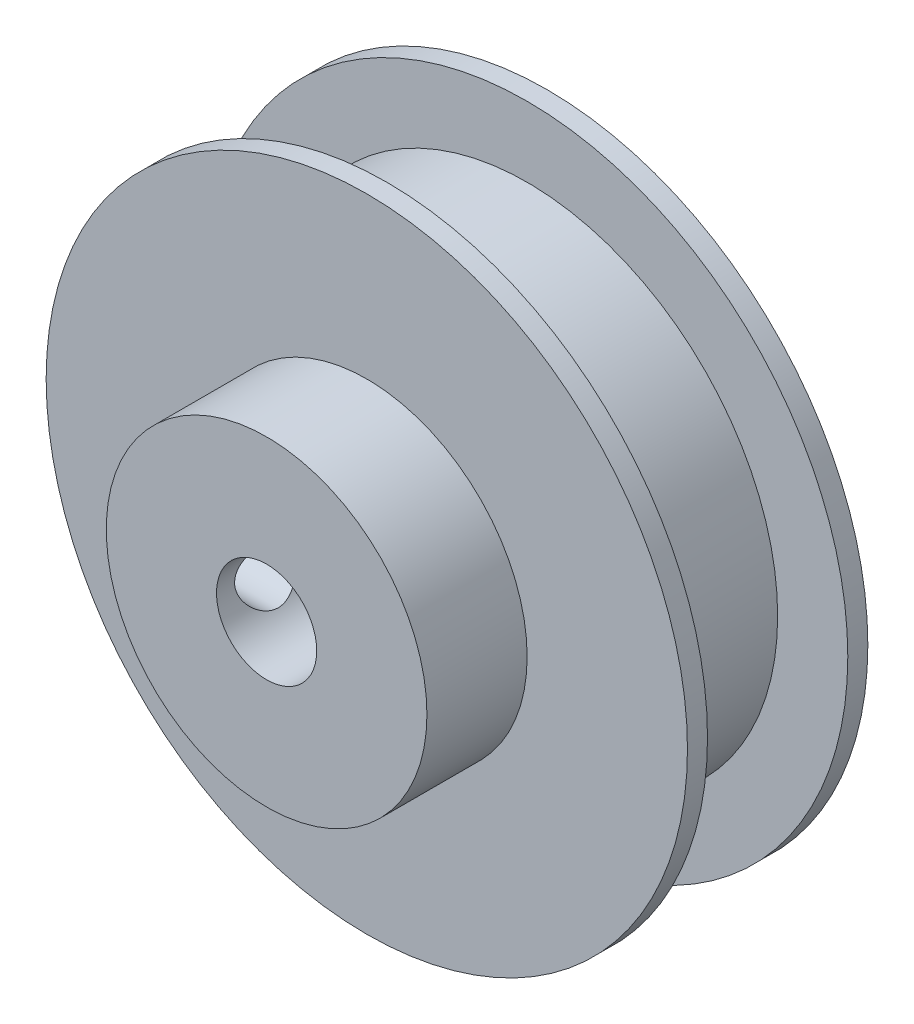
ISO-10303-21;
HEADER;
FILE_DESCRIPTION(('STEP AP214'),'2;1');
FILE_NAME('part.step','',(''),(''),'','','');
FILE_SCHEMA(('AUTOMOTIVE_DESIGN { 1 0 10303 214 1 1 1 1 }'));
ENDSEC;
DATA;
#1=APPLICATION_CONTEXT('core data for automotive mechanical design processes');
#2=APPLICATION_PROTOCOL_DEFINITION('international standard','automotive_design',2000,#1);
#3=PRODUCT_CONTEXT('',#1,'mechanical');
#4=PRODUCT('Part','Part','',(#3));
#5=PRODUCT_RELATED_PRODUCT_CATEGORY('part','',(#4));
#6=PRODUCT_DEFINITION_FORMATION('','',#4);
#7=PRODUCT_DEFINITION_CONTEXT('part definition',#1,'design');
#8=PRODUCT_DEFINITION('design','',#6,#7);
#9=PRODUCT_DEFINITION_SHAPE('','',#8);
#10=(LENGTH_UNIT() NAMED_UNIT(*) SI_UNIT(.MILLI.,.METRE.));
#11=(NAMED_UNIT(*) PLANE_ANGLE_UNIT() SI_UNIT($,.RADIAN.));
#12=(NAMED_UNIT(*) SI_UNIT($,.STERADIAN.) SOLID_ANGLE_UNIT());
#13=UNCERTAINTY_MEASURE_WITH_UNIT(LENGTH_MEASURE(1.E-05),#10,'distance_accuracy_value','');
#14=(GEOMETRIC_REPRESENTATION_CONTEXT(3) GLOBAL_UNCERTAINTY_ASSIGNED_CONTEXT((#13)) GLOBAL_UNIT_ASSIGNED_CONTEXT((#10,
#11,#12)) REPRESENTATION_CONTEXT('',''));
#15=CARTESIAN_POINT('',(0.,0.,0.));
#16=DIRECTION('',(0.,0.,1.));
#17=DIRECTION('',(1.,0.,0.));
#18=AXIS2_PLACEMENT_3D('',#15,#16,#17);
#19=CARTESIAN_POINT('',(0.,0.,1.));
#20=DIRECTION('',(0.,0.,-1.));
#21=DIRECTION('',(-1.,0.,0.));
#22=AXIS2_PLACEMENT_3D('',#19,#20,#21);
#23=CYLINDRICAL_SURFACE('',#22,16.);
#24=CARTESIAN_POINT('',(0.,0.,1.));
#25=DIRECTION('',(0.,0.,1.));
#26=DIRECTION('',(1.,0.,0.));
#27=AXIS2_PLACEMENT_3D('',#24,#25,#26);
#28=CIRCLE('',#27,16.);
#29=CARTESIAN_POINT('',(16.,0.,1.));
#30=VERTEX_POINT('',#29);
#31=EDGE_CURVE('E151',#30,#30,#28,.T.);
#32=ORIENTED_EDGE('',*,*,#31,.F.);
#33=EDGE_LOOP('',(#32));
#34=FACE_BOUND('',#33,.T.);
#35=CARTESIAN_POINT('',(0.,0.,0.));
#36=DIRECTION('',(0.,0.,1.));
#37=DIRECTION('',(1.,0.,0.));
#38=AXIS2_PLACEMENT_3D('',#35,#36,#37);
#39=CIRCLE('',#38,16.);
#40=CARTESIAN_POINT('',(16.,0.,0.));
#41=VERTEX_POINT('',#40);
#42=EDGE_CURVE('E148',#41,#41,#39,.T.);
#43=ORIENTED_EDGE('',*,*,#42,.T.);
#44=EDGE_LOOP('',(#43));
#45=FACE_BOUND('',#44,.T.);
#46=ADVANCED_FACE('F39',(#34,#45),#23,.T.);
#47=CARTESIAN_POINT('',(0.,0.,1.));
#48=DIRECTION('',(0.,0.,1.));
#49=DIRECTION('',(1.,0.,0.));
#50=AXIS2_PLACEMENT_3D('',#47,#48,#49);
#51=PLANE('',#50);
#52=CARTESIAN_POINT('',(0.,0.,1.));
#53=DIRECTION('',(0.,0.,1.));
#54=DIRECTION('',(1.,0.,0.));
#55=AXIS2_PLACEMENT_3D('',#52,#53,#54);
#56=CIRCLE('',#55,12.5);
#57=CARTESIAN_POINT('',(12.5,0.,1.));
#58=VERTEX_POINT('',#57);
#59=EDGE_CURVE('E142',#58,#58,#56,.T.);
#60=ORIENTED_EDGE('',*,*,#59,.F.);
#61=EDGE_LOOP('',(#60));
#62=FACE_BOUND('',#61,.T.);
#63=ORIENTED_EDGE('',*,*,#31,.T.);
#64=EDGE_LOOP('',(#63));
#65=FACE_BOUND('',#64,.T.);
#66=ADVANCED_FACE('F165',(#62,#65),#51,.T.);
#67=CARTESIAN_POINT('',(0.,0.,0.));
#68=DIRECTION('',(0.,0.,1.));
#69=DIRECTION('',(1.,0.,0.));
#70=AXIS2_PLACEMENT_3D('',#67,#68,#69);
#71=PLANE('',#70);
#72=CARTESIAN_POINT('',(0.,0.,0.));
#73=DIRECTION('',(0.,0.,1.));
#74=DIRECTION('',(1.,0.,0.));
#75=AXIS2_PLACEMENT_3D('',#72,#73,#74);
#76=CIRCLE('',#75,2.5);
#77=CARTESIAN_POINT('',(2.5,0.,0.));
#78=VERTEX_POINT('',#77);
#79=EDGE_CURVE('E85',#78,#78,#76,.T.);
#80=ORIENTED_EDGE('',*,*,#79,.T.);
#81=EDGE_LOOP('',(#80));
#82=FACE_BOUND('',#81,.T.);
#83=ORIENTED_EDGE('',*,*,#42,.F.);
#84=EDGE_LOOP('',(#83));
#85=FACE_BOUND('',#84,.T.);
#86=ADVANCED_FACE('F162',(#82,#85),#71,.F.);
#87=CARTESIAN_POINT('',(0.,0.,8.));
#88=DIRECTION('',(0.,0.,-1.));
#89=DIRECTION('',(-1.,0.,0.));
#90=AXIS2_PLACEMENT_3D('',#87,#88,#89);
#91=CYLINDRICAL_SURFACE('',#90,12.5);
#92=CARTESIAN_POINT('',(0.,0.,8.));
#93=DIRECTION('',(0.,0.,1.));
#94=DIRECTION('',(1.,0.,0.));
#95=AXIS2_PLACEMENT_3D('',#92,#93,#94);
#96=CIRCLE('',#95,12.5);
#97=CARTESIAN_POINT('',(12.5,0.,8.));
#98=VERTEX_POINT('',#97);
#99=EDGE_CURVE('E144',#98,#98,#96,.T.);
#100=ORIENTED_EDGE('',*,*,#99,.F.);
#101=EDGE_LOOP('',(#100));
#102=FACE_BOUND('',#101,.T.);
#103=ORIENTED_EDGE('',*,*,#59,.T.);
#104=EDGE_LOOP('',(#103));
#105=FACE_BOUND('',#104,.T.);
#106=ADVANCED_FACE('F164',(#102,#105),#91,.T.);
#107=CARTESIAN_POINT('',(0.,0.,9.));
#108=DIRECTION('',(0.,0.,-1.));
#109=DIRECTION('',(-1.,0.,0.));
#110=AXIS2_PLACEMENT_3D('',#107,#108,#109);
#111=CYLINDRICAL_SURFACE('',#110,16.);
#112=CARTESIAN_POINT('',(0.,0.,9.));
#113=DIRECTION('',(0.,0.,1.));
#114=DIRECTION('',(1.,0.,0.));
#115=AXIS2_PLACEMENT_3D('',#112,#113,#114);
#116=CIRCLE('',#115,16.);
#117=CARTESIAN_POINT('',(16.,0.,9.));
#118=VERTEX_POINT('',#117);
#119=EDGE_CURVE('E136',#118,#118,#116,.T.);
#120=ORIENTED_EDGE('',*,*,#119,.F.);
#121=EDGE_LOOP('',(#120));
#122=FACE_BOUND('',#121,.T.);
#123=CARTESIAN_POINT('',(0.,0.,8.));
#124=DIRECTION('',(0.,0.,1.));
#125=DIRECTION('',(1.,0.,0.));
#126=AXIS2_PLACEMENT_3D('',#123,#124,#125);
#127=CIRCLE('',#126,16.);
#128=CARTESIAN_POINT('',(16.,0.,8.));
#129=VERTEX_POINT('',#128);
#130=EDGE_CURVE('E133',#129,#129,#127,.T.);
#131=ORIENTED_EDGE('',*,*,#130,.T.);
#132=EDGE_LOOP('',(#131));
#133=FACE_BOUND('',#132,.T.);
#134=ADVANCED_FACE('F171',(#122,#133),#111,.T.);
#135=CARTESIAN_POINT('',(0.,0.,9.));
#136=DIRECTION('',(0.,0.,1.));
#137=DIRECTION('',(1.,0.,0.));
#138=AXIS2_PLACEMENT_3D('',#135,#136,#137);
#139=PLANE('',#138);
#140=CARTESIAN_POINT('',(0.,0.,9.));
#141=DIRECTION('',(0.,0.,1.));
#142=DIRECTION('',(1.,0.,0.));
#143=AXIS2_PLACEMENT_3D('',#140,#141,#142);
#144=CIRCLE('',#143,8.);
#145=CARTESIAN_POINT('',(8.,0.,9.));
#146=VERTEX_POINT('',#145);
#147=EDGE_CURVE('E139',#146,#146,#144,.T.);
#148=ORIENTED_EDGE('',*,*,#147,.F.);
#149=EDGE_LOOP('',(#148));
#150=FACE_BOUND('',#149,.T.);
#151=ORIENTED_EDGE('',*,*,#119,.T.);
#152=EDGE_LOOP('',(#151));
#153=FACE_BOUND('',#152,.T.);
#154=ADVANCED_FACE('F197',(#150,#153),#139,.T.);
#155=CARTESIAN_POINT('',(0.,0.,8.));
#156=DIRECTION('',(0.,0.,1.));
#157=DIRECTION('',(1.,0.,0.));
#158=AXIS2_PLACEMENT_3D('',#155,#156,#157);
#159=PLANE('',#158);
#160=ORIENTED_EDGE('',*,*,#99,.T.);
#161=EDGE_LOOP('',(#160));
#162=FACE_BOUND('',#161,.T.);
#163=ORIENTED_EDGE('',*,*,#130,.F.);
#164=EDGE_LOOP('',(#163));
#165=FACE_BOUND('',#164,.T.);
#166=ADVANCED_FACE('F203',(#162,#165),#159,.F.);
#167=CARTESIAN_POINT('',(0.,0.,14.));
#168=DIRECTION('',(0.,0.,-1.));
#169=DIRECTION('',(-1.,0.,0.));
#170=AXIS2_PLACEMENT_3D('',#167,#168,#169);
#171=CYLINDRICAL_SURFACE('',#170,8.);
#172=CARTESIAN_POINT('',(-7.97500000000002,0.631961232988012,10.0276321537289));
#173=CARTESIAN_POINT('',(-7.97171084041507,0.67348646011469,10.0454856592935));
#174=CARTESIAN_POINT('',(-7.96815530054194,0.714215835843508,10.0650822216716));
#175=CARTESIAN_POINT('',(-7.96061653509265,0.793838476823681,10.1076250452742));
#176=CARTESIAN_POINT('',(-7.95663336002974,0.832731958155458,10.1305709109862));
#177=CARTESIAN_POINT('',(-7.94421164596415,0.946188068559289,10.2041580388905));
#178=CARTESIAN_POINT('',(-7.93528997426631,1.01765773313837,10.2596055276841));
#179=CARTESIAN_POINT('',(-7.91716470895765,1.15021692284543,10.3816833736278));
#180=CARTESIAN_POINT('',(-7.90796106242566,1.21130448519484,10.4483158406211));
#181=CARTESIAN_POINT('',(-7.8903027390867,1.32145307457889,10.5909650916961));
#182=CARTESIAN_POINT('',(-7.88184796245985,1.37051570601009,10.6669806218287));
#183=CARTESIAN_POINT('',(-7.86664044363331,1.45527851252611,10.8264684672799));
#184=CARTESIAN_POINT('',(-7.85989080424643,1.49095438434473,10.9099540072646));
#185=CARTESIAN_POINT('',(-7.84891042705562,1.54772359805362,11.0819103210527));
#186=CARTESIAN_POINT('',(-7.84467963350897,1.56881726265361,11.1703809844867));
#187=CARTESIAN_POINT('',(-7.83929371906358,1.59551202643753,11.3482276077901));
#188=CARTESIAN_POINT('',(-7.83808906850941,1.60136267199632,11.4375646315055));
#189=CARTESIAN_POINT('',(-7.83875419899543,1.59810372129701,11.6159488711841));
#190=CARTESIAN_POINT('',(-7.84062374349582,1.58899527604603,11.7049961089162));
#191=CARTESIAN_POINT('',(-7.84717807863927,1.55629869218386,11.8792557803998));
#192=CARTESIAN_POINT('',(-7.85183159872163,1.53287132619631,11.9644996725423));
#193=CARTESIAN_POINT('',(-7.86339592733227,1.47239468633041,12.1298392127119));
#194=CARTESIAN_POINT('',(-7.87030677247967,1.43534519146794,12.2099347771957));
#195=CARTESIAN_POINT('',(-7.88570862384813,1.34817396634834,12.3637564494264));
#196=CARTESIAN_POINT('',(-7.89421729156081,1.29790333308293,12.4373963741139));
#197=CARTESIAN_POINT('',(-7.91181731016957,1.18589823523296,12.5752858113674));
#198=CARTESIAN_POINT('',(-7.92090870536453,1.12416289842459,12.6395346088003));
#199=CARTESIAN_POINT('',(-7.93822295372057,0.994316934293497,12.7538889979822));
#200=CARTESIAN_POINT('',(-7.94646637910282,0.92670620423098,12.8045571517864));
#201=CARTESIAN_POINT('',(-7.95795203182684,0.819931442183316,12.8721271689533));
#202=CARTESIAN_POINT('',(-7.96163556120623,0.783427900156191,12.893253266324));
#203=CARTESIAN_POINT('',(-7.96862349428195,0.708834284002369,12.9325753753311));
#204=CARTESIAN_POINT('',(-7.97192784574389,0.670743992272735,12.9507709834113));
#205=CARTESIAN_POINT('',(-7.97500000000002,0.631961232988011,12.9674450729469));
#206=B_SPLINE_CURVE_WITH_KNOTS('',3,(#172,#173,#174,#175,#176,#177,#178,#179,#180,#181,#182,
#183,#184,#185,#186,#187,#188,#189,#190,#191,#192,#193,#194,#195,#196,#197,#198,#199,#200,#201,
#202,#203,#204,#205),.UNSPECIFIED.,.F.,.F.,(4,2,2,2,2,2,2,2,2,2,2,2,2,2,2,2,4),(0.,
0.135873787455716,0.271731542808688,0.543022073837377,0.814363836527012,1.08566937638346,
1.35746510735896,1.6292548232003,1.89656622084899,2.16385705154518,2.42820051165938,
2.69254826025797,2.96001118192191,3.22749446025462,3.48103831791956,3.6079323392248,
3.73484382012281),.UNSPECIFIED.);
#207=CARTESIAN_POINT('',(-7.97500000000002,0.631961232988013,10.0276321537289));
#208=VERTEX_POINT('',#207);
#209=CARTESIAN_POINT('',(-7.97500000000002,0.631961232988012,12.9674450729469));
#210=VERTEX_POINT('',#209);
#211=EDGE_CURVE('E77',#208,#210,#206,.T.);
#212=ORIENTED_EDGE('',*,*,#211,.T.);
#213=CARTESIAN_POINT('',(-7.97230000000002,0.665156154598097,12.9497557389773));
#214=CARTESIAN_POINT('',(-7.975202214147,0.630378135176145,12.9688764049939));
#215=CARTESIAN_POINT('',(-7.97793946225064,0.594812504786045,12.9865583724896));
#216=CARTESIAN_POINT('',(-7.98301560976061,0.522287844955475,13.0188874835856));
#217=CARTESIAN_POINT('',(-7.98535438237147,0.48532837654587,13.0335336615133));
#218=CARTESIAN_POINT('',(-7.99165524773398,0.372887522929725,13.0725883865182));
#219=CARTESIAN_POINT('',(-7.99491981371093,0.295636281561371,13.0922277599139));
#220=CARTESIAN_POINT('',(-7.99914318136852,0.140196837185956,13.1175027530258));
#221=CARTESIAN_POINT('',(-8.00014026426034,0.0620469314625585,13.1233709228767));
#222=CARTESIAN_POINT('',(-7.99982764027431,-0.0940946112564062,13.1215161947953));
#223=CARTESIAN_POINT('',(-7.99851823366998,-0.172086267530556,13.1137950660047));
#224=CARTESIAN_POINT('',(-7.99386341914905,-0.321620072434586,13.0858583812136));
#225=CARTESIAN_POINT('',(-7.99062393175648,-0.393289178012809,13.0662920345325));
#226=CARTESIAN_POINT('',(-7.98256045271822,-0.532659480398054,13.0161038935053));
#227=CARTESIAN_POINT('',(-7.97773452952876,-0.600355721090696,12.9854686178031));
#228=CARTESIAN_POINT('',(-7.97230000000002,-0.665156154598097,12.9497557389773));
#229=B_SPLINE_CURVE_WITH_KNOTS('',3,(#213,#214,#215,#216,#217,#218,#219,#220,#221,#222,#223,
#224,#225,#226,#227,#228),.UNSPECIFIED.,.F.,.F.,(4,2,2,2,2,2,2,4),(0.,0.119313553585653,
0.238665002295486,0.476664231704752,0.710614581250199,0.944534475896942,1.1666669705961,
1.38907092769231),.UNSPECIFIED.);
#230=CARTESIAN_POINT('',(-7.97500000000002,-0.631961232988012,12.9674450729469));
#231=VERTEX_POINT('',#230);
#232=EDGE_CURVE('E11',#210,#231,#229,.T.);
#233=ORIENTED_EDGE('',*,*,#232,.T.);
#234=CARTESIAN_POINT('',(-7.97500000000002,-0.631961232988012,12.9674450729469));
#235=CARTESIAN_POINT('',(-7.97171084041507,-0.67348646011469,12.9495915673823));
#236=CARTESIAN_POINT('',(-7.96815530054194,-0.714215835843508,12.9299950050042));
#237=CARTESIAN_POINT('',(-7.96061653509265,-0.793838476823681,12.8874521814016));
#238=CARTESIAN_POINT('',(-7.95663336002974,-0.832731958155458,12.8645063156896));
#239=CARTESIAN_POINT('',(-7.94421164596415,-0.946188068559289,12.7909191877853));
#240=CARTESIAN_POINT('',(-7.93528997426631,-1.01765773313837,12.7354716989917));
#241=CARTESIAN_POINT('',(-7.91716470895765,-1.15021692284543,12.613393853048));
#242=CARTESIAN_POINT('',(-7.90796106242566,-1.21130448519484,12.5467613860547));
#243=CARTESIAN_POINT('',(-7.8903027390867,-1.32145307457889,12.4041121349797));
#244=CARTESIAN_POINT('',(-7.88184796245985,-1.37051570601009,12.3280966048471));
#245=CARTESIAN_POINT('',(-7.86664044363331,-1.45527851252611,12.1686087593959));
#246=CARTESIAN_POINT('',(-7.85989080424643,-1.49095438434473,12.0851232194113));
#247=CARTESIAN_POINT('',(-7.84891042705562,-1.54772359805362,11.9131669056231));
#248=CARTESIAN_POINT('',(-7.84467963350897,-1.56881726265361,11.8246962421891));
#249=CARTESIAN_POINT('',(-7.83929371906358,-1.59551202643753,11.6468496188858));
#250=CARTESIAN_POINT('',(-7.83808906850941,-1.60136267199632,11.5575125951703));
#251=CARTESIAN_POINT('',(-7.83875419899543,-1.59810372129701,11.3791283554917));
#252=CARTESIAN_POINT('',(-7.84062374349582,-1.58899527604603,11.2900811177597));
#253=CARTESIAN_POINT('',(-7.84717807863927,-1.55629869218386,11.115821446276));
#254=CARTESIAN_POINT('',(-7.85183159872163,-1.53287132619631,11.0305775541335));
#255=CARTESIAN_POINT('',(-7.86339592733227,-1.47239468633041,10.865238013964));
#256=CARTESIAN_POINT('',(-7.87030677247967,-1.43534519146794,10.7851424494801));
#257=CARTESIAN_POINT('',(-7.88570862384813,-1.34817396634834,10.6313207772494));
#258=CARTESIAN_POINT('',(-7.89421729156081,-1.29790333308293,10.557680852562));
#259=CARTESIAN_POINT('',(-7.91181731016957,-1.18589823523296,10.4197914153084));
#260=CARTESIAN_POINT('',(-7.92090870536453,-1.12416289842459,10.3555426178755));
#261=CARTESIAN_POINT('',(-7.93822295372057,-0.994316934293497,10.2411882286937));
#262=CARTESIAN_POINT('',(-7.94646637910282,-0.92670620423098,10.1905200748894));
#263=CARTESIAN_POINT('',(-7.95795203182684,-0.819931442183316,10.1229500577225));
#264=CARTESIAN_POINT('',(-7.96163556120623,-0.783427900156191,10.1018239603518));
#265=CARTESIAN_POINT('',(-7.96862349428195,-0.708834284002369,10.0625018513447));
#266=CARTESIAN_POINT('',(-7.97192784574389,-0.670743992272735,10.0443062432645));
#267=CARTESIAN_POINT('',(-7.97500000000002,-0.631961232988011,10.0276321537289));
#268=B_SPLINE_CURVE_WITH_KNOTS('',3,(#234,#235,#236,#237,#238,#239,#240,#241,#242,#243,#244,
#245,#246,#247,#248,#249,#250,#251,#252,#253,#254,#255,#256,#257,#258,#259,#260,#261,#262,#263,
#264,#265,#266,#267),.UNSPECIFIED.,.F.,.F.,(4,2,2,2,2,2,2,2,2,2,2,2,2,2,2,2,4),(0.,
0.135873787455716,0.271731542808688,0.543022073837377,0.814363836527012,1.08566937638346,
1.35746510735896,1.6292548232003,1.89656622084899,2.16385705154518,2.42820051165938,
2.69254826025797,2.96001118192191,3.22749446025462,3.48103831791956,3.6079323392248,
3.73484382012281),.UNSPECIFIED.);
#269=CARTESIAN_POINT('',(-7.97500000000002,-0.631961232988012,10.0276321537289));
#270=VERTEX_POINT('',#269);
#271=EDGE_CURVE('E65',#231,#270,#268,.T.);
#272=ORIENTED_EDGE('',*,*,#271,.T.);
#273=CARTESIAN_POINT('',(-7.97230000000002,-0.665156154598097,10.0453214876986));
#274=CARTESIAN_POINT('',(-7.975202214147,-0.630378135176145,10.0262008216819));
#275=CARTESIAN_POINT('',(-7.97793946225064,-0.594812504786045,10.0085188541863));
#276=CARTESIAN_POINT('',(-7.98301560976061,-0.522287844955475,9.9761897430902));
#277=CARTESIAN_POINT('',(-7.98535438237147,-0.48532837654587,9.96154356516251));
#278=CARTESIAN_POINT('',(-7.99165524773398,-0.372887522929725,9.92248884015763));
#279=CARTESIAN_POINT('',(-7.99491981371093,-0.295636281561371,9.90284946676192));
#280=CARTESIAN_POINT('',(-7.99914318136852,-0.140196837185956,9.87757447364999));
#281=CARTESIAN_POINT('',(-8.00014026426034,-0.0620469314625585,9.87170630379909));
#282=CARTESIAN_POINT('',(-7.99982764027431,0.0940946112564062,9.87356103188051));
#283=CARTESIAN_POINT('',(-7.99851823366998,0.172086267530556,9.88128216067109));
#284=CARTESIAN_POINT('',(-7.99386341914905,0.321620072434586,9.90921884546228));
#285=CARTESIAN_POINT('',(-7.99062393175648,0.393289178012809,9.9287851921433));
#286=CARTESIAN_POINT('',(-7.98256045271822,0.532659480398054,9.9789733331705));
#287=CARTESIAN_POINT('',(-7.97773452952876,0.600355721090696,10.0096086088727));
#288=CARTESIAN_POINT('',(-7.97230000000002,0.665156154598097,10.0453214876986));
#289=B_SPLINE_CURVE_WITH_KNOTS('',3,(#273,#274,#275,#276,#277,#278,#279,#280,#281,#282,#283,
#284,#285,#286,#287,#288),.UNSPECIFIED.,.F.,.F.,(4,2,2,2,2,2,2,4),(0.,0.119313553585653,
0.238665002295486,0.476664231704752,0.710614581250199,0.944534475896942,1.1666669705961,
1.38907092769231),.UNSPECIFIED.);
#290=EDGE_CURVE('E52',#270,#208,#289,.T.);
#291=ORIENTED_EDGE('',*,*,#290,.T.);
#292=EDGE_LOOP('',(#212,#233,#272,#291));
#293=FACE_BOUND('',#292,.T.);
#294=CARTESIAN_POINT('',(0.,0.,14.));
#295=DIRECTION('',(0.,0.,1.));
#296=DIRECTION('',(1.,0.,0.));
#297=AXIS2_PLACEMENT_3D('',#294,#295,#296);
#298=CIRCLE('',#297,8.);
#299=CARTESIAN_POINT('',(8.,0.,14.));
#300=VERTEX_POINT('',#299);
#301=EDGE_CURVE('E132',#300,#300,#298,.T.);
#302=ORIENTED_EDGE('',*,*,#301,.F.);
#303=EDGE_LOOP('',(#302));
#304=FACE_BOUND('',#303,.T.);
#305=ORIENTED_EDGE('',*,*,#147,.T.);
#306=EDGE_LOOP('',(#305));
#307=FACE_BOUND('',#306,.T.);
#308=ADVANCED_FACE('F80',(#293,#304,#307),#171,.T.);
#309=CARTESIAN_POINT('',(0.,0.,14.));
#310=DIRECTION('',(0.,0.,1.));
#311=DIRECTION('',(1.,0.,0.));
#312=AXIS2_PLACEMENT_3D('',#309,#310,#311);
#313=PLANE('',#312);
#314=CARTESIAN_POINT('',(0.,0.,14.));
#315=DIRECTION('',(0.,0.,1.));
#316=DIRECTION('',(1.,0.,0.));
#317=AXIS2_PLACEMENT_3D('',#314,#315,#316);
#318=CIRCLE('',#317,2.5);
#319=CARTESIAN_POINT('',(2.5,0.,14.));
#320=VERTEX_POINT('',#319);
#321=EDGE_CURVE('E82',#320,#320,#318,.T.);
#322=ORIENTED_EDGE('',*,*,#321,.F.);
#323=EDGE_LOOP('',(#322));
#324=FACE_BOUND('',#323,.T.);
#325=ORIENTED_EDGE('',*,*,#301,.T.);
#326=EDGE_LOOP('',(#325));
#327=FACE_BOUND('',#326,.T.);
#328=ADVANCED_FACE('F122',(#324,#327),#313,.T.);
#329=CARTESIAN_POINT('',(0.,0.,0.));
#330=DIRECTION('',(0.,0.,1.));
#331=DIRECTION('',(1.,0.,0.));
#332=AXIS2_PLACEMENT_3D('',#329,#330,#331);
#333=CYLINDRICAL_SURFACE('',#332,2.5);
#334=CARTESIAN_POINT('',(-2.5,0.,13.0975386133379));
#335=CARTESIAN_POINT('',(-2.49999373478122,0.0809465291327141,13.0975318128639));
#336=CARTESIAN_POINT('',(-2.49602800483229,0.161978714239318,13.0913541939068));
#337=CARTESIAN_POINT('',(-2.48053880851594,0.321532240877509,13.0669835708532));
#338=CARTESIAN_POINT('',(-2.46900276007789,0.400049173738108,13.0487705632684));
#339=CARTESIAN_POINT('',(-2.43952804374761,0.551962103584108,13.0014129901623));
#340=CARTESIAN_POINT('',(-2.42162124050247,0.62538145134433,12.9723227928819));
#341=CARTESIAN_POINT('',(-2.38087710607185,0.766024179802999,12.9044189473548));
#342=CARTESIAN_POINT('',(-2.35804006543092,0.833247925282437,12.8656058720668));
#343=CARTESIAN_POINT('',(-2.30708893904171,0.965808013791172,12.7758722472105));
#344=CARTESIAN_POINT('',(-2.27869604004543,1.03054049909709,12.7242211667217));
#345=CARTESIAN_POINT('',(-2.2202876512534,1.15100614853988,12.6119784936974));
#346=CARTESIAN_POINT('',(-2.19026995344606,1.20672663413539,12.5513745310826));
#347=CARTESIAN_POINT('',(-2.12682160476874,1.31573031751228,12.4128019772193));
#348=CARTESIAN_POINT('',(-2.09351856777285,1.36751904529823,12.3335895308105));
#349=CARTESIAN_POINT('',(-2.03231641722275,1.4569252620881,12.1656534005715));
#350=CARTESIAN_POINT('',(-2.00440807432674,1.49456706002439,12.0769463716743));
#351=CARTESIAN_POINT('',(-1.96506941451095,1.54571994621924,11.9168018388457));
#352=CARTESIAN_POINT('',(-1.95122462500058,1.56300203311438,11.847166648692));
#353=CARTESIAN_POINT('',(-1.93085974657066,1.58809633195386,11.7052068557009));
#354=CARTESIAN_POINT('',(-1.92432852519843,1.59592293813043,11.6328865139645));
#355=CARTESIAN_POINT('',(-1.91958400971203,1.60162869479515,11.4873449964188));
#356=CARTESIAN_POINT('',(-1.9213964298311,1.59947709333702,11.4141217303005));
#357=CARTESIAN_POINT('',(-1.93310041934094,1.58530767623303,11.2692729902321));
#358=CARTESIAN_POINT('',(-1.94299865478457,1.57328171999679,11.1976488847214));
#359=CARTESIAN_POINT('',(-1.96901231320557,1.54058583436825,11.0599780701516));
#360=CARTESIAN_POINT('',(-1.9849337786339,1.5201840309724,10.9938287798879));
#361=CARTESIAN_POINT('',(-2.02122165880276,1.47159113105818,10.8657831746551));
#362=CARTESIAN_POINT('',(-2.04158954958856,1.44339744710114,10.8038882809777));
#363=CARTESIAN_POINT('',(-2.08922627037342,1.37376676759634,10.6733759055205));
#364=CARTESIAN_POINT('',(-2.11706797105538,1.33082320515131,10.6057722946921));
#365=CARTESIAN_POINT('',(-2.1739956981761,1.23564764355398,10.4779631519934));
#366=CARTESIAN_POINT('',(-2.20308316755738,1.1834046393298,10.4177665299754));
#367=CARTESIAN_POINT('',(-2.26543285211594,1.05991806168004,10.2952691063918));
#368=CARTESIAN_POINT('',(-2.29848920685381,0.986946893268192,10.2345859984919));
#369=CARTESIAN_POINT('',(-2.359688609273,0.830022968093879,10.1263650775255));
#370=CARTESIAN_POINT('',(-2.38783689397334,0.746082085718432,10.0788132210936));
#371=CARTESIAN_POINT('',(-2.43131140919962,0.586635550991735,10.0069285359887));
#372=CARTESIAN_POINT('',(-2.44807310922167,0.512753928414275,9.97986196474907));
#373=CARTESIAN_POINT('',(-2.47504180751747,0.360710175816507,9.93673179139338));
#374=CARTESIAN_POINT('',(-2.4852540740069,0.282551541195585,9.92065934515795));
#375=CARTESIAN_POINT('',(-2.49820514305433,0.123815634695004,9.90032497577729));
#376=CARTESIAN_POINT('',(-2.50091888316294,0.0432311597035597,9.8961026587798));
#377=CARTESIAN_POINT('',(-2.49852887198075,-0.117542286289562,9.89983751919036));
#378=CARTESIAN_POINT('',(-2.49342466188541,-0.197731233802228,9.90779541140666));
#379=CARTESIAN_POINT('',(-2.47637451376673,-0.351006156661023,9.93467900508232));
#380=CARTESIAN_POINT('',(-2.46480663552248,-0.424243126849567,9.95299928234527));
#381=CARTESIAN_POINT('',(-2.43607037965005,-0.566415484435881,9.99928391293529));
#382=CARTESIAN_POINT('',(-2.41890106050777,-0.635350146361166,10.0272498875976));
#383=CARTESIAN_POINT('',(-2.37877118462254,-0.772615564352516,10.0942123953957));
#384=CARTESIAN_POINT('',(-2.35547539636836,-0.840521814887448,10.1338735309696));
#385=CARTESIAN_POINT('',(-2.30558482599355,-0.969041009865648,10.2219836600875));
#386=CARTESIAN_POINT('',(-2.27898748986338,-1.02964823562874,10.2704394705716));
#387=CARTESIAN_POINT('',(-2.22016403044038,-1.15157305211654,10.3831823621885));
#388=CARTESIAN_POINT('',(-2.18769843253542,-1.21158689465292,10.4487569634097));
#389=CARTESIAN_POINT('',(-2.12390873827501,-1.32021949695439,10.5892928245385));
#390=CARTESIAN_POINT('',(-2.09258486725736,-1.36883601745304,10.6642559246016));
#391=CARTESIAN_POINT('',(-2.03864659589321,-1.44771753628643,10.8118816619487));
#392=CARTESIAN_POINT('',(-2.01542700480048,-1.47958112170676,10.8834635827295));
#393=CARTESIAN_POINT('',(-1.97524043785176,-1.53282212869391,11.0320643405259));
#394=CARTESIAN_POINT('',(-1.95826478854658,-1.55421411012882,11.1090754571712));
#395=CARTESIAN_POINT('',(-1.93305268936487,-1.58547514853104,11.2676558699165));
#396=CARTESIAN_POINT('',(-1.92489997570192,-1.59523388426507,11.3492612383313));
#397=CARTESIAN_POINT('',(-1.91925764740911,-1.60202308952287,11.5133476472929));
#398=CARTESIAN_POINT('',(-1.92176029238759,-1.59906279853819,11.5958280087835));
#399=CARTESIAN_POINT('',(-1.93577077408218,-1.58204765912499,11.7466227840724));
#400=CARTESIAN_POINT('',(-1.94592963240223,-1.56965222422198,11.8152664502788));
#401=CARTESIAN_POINT('',(-1.97224844367527,-1.53645153543921,11.9493037558576));
#402=CARTESIAN_POINT('',(-1.98841434501086,-1.51563794379521,12.0146941006565));
#403=CARTESIAN_POINT('',(-2.03132559529757,-1.45787799915051,12.1630720768807));
#404=CARTESIAN_POINT('',(-2.05979688602196,-1.41784373882589,12.2443563115962));
#405=CARTESIAN_POINT('',(-2.12039210845437,-1.32551551302481,12.3981370961698));
#406=CARTESIAN_POINT('',(-2.15252094162923,-1.27320499415655,12.4706215783585));
#407=CARTESIAN_POINT('',(-2.21734561230738,-1.15666472100031,12.6066981943987));
#408=CARTESIAN_POINT('',(-2.25004367113503,-1.09230184419141,12.6701755446364));
#409=CARTESIAN_POINT('',(-2.31251135077165,-0.952958939292196,12.7859803739507));
#410=CARTESIAN_POINT('',(-2.34228091431827,-0.877978703665195,12.8383076350273));
#411=CARTESIAN_POINT('',(-2.39686635130217,-0.715912032693979,12.9315702020839));
#412=CARTESIAN_POINT('',(-2.42149529879162,-0.628517200456203,12.9720918454552));
#413=CARTESIAN_POINT('',(-2.45158227355125,-0.491867628909329,13.0208284043914));
#414=CARTESIAN_POINT('',(-2.46046425402859,-0.445430003155367,13.0350598440658));
#415=CARTESIAN_POINT('',(-2.4756864261471,-0.351072648099778,13.059304967639));
#416=CARTESIAN_POINT('',(-2.48202839394244,-0.303153979792198,13.0693215990749));
#417=CARTESIAN_POINT('',(-2.49128524954684,-0.21278519857304,13.0838958018465));
#418=CARTESIAN_POINT('',(-2.49454442057938,-0.170458191835631,13.089003311444));
#419=CARTESIAN_POINT('',(-2.4989034737162,-0.085428750536024,13.0958265502976));
#420=CARTESIAN_POINT('',(-2.50000330699373,-0.042726307506422,13.0975422028574));
#421=CARTESIAN_POINT('',(-2.5,0.,13.0975386133379));
#422=B_SPLINE_CURVE_WITH_KNOTS('',3,(#334,#335,#336,#337,#338,#339,#340,#341,#342,#343,#344,
#345,#346,#347,#348,#349,#350,#351,#352,#353,#354,#355,#356,#357,#358,#359,#360,#361,#362,#363,
#364,#365,#366,#367,#368,#369,#370,#371,#372,#373,#374,#375,#376,#377,#378,#379,#380,#381,#382,
#383,#384,#385,#386,#387,#388,#389,#390,#391,#392,#393,#394,#395,#396,#397,#398,#399,#400,#401,
#402,#403,#404,#405,#406,#407,#408,#409,#410,#411,#412,#413,#414,#415,#416,#417,#418,#419,#420,
#421),.UNSPECIFIED.,.T.,.F.,(4,2,2,2,2,2,2,2,2,2,2,2,2,2,2,2,2,2,2,2,2,2,2,2,2,2,2,2,2,2,2,2,2,
2,2,2,2,2,2,2,2,2,2,4),(0.,0.242668102535663,0.485740550885227,0.727613930252437,
0.969473059632693,1.23110984524596,1.4931115719164,1.79267227249294,2.09171585301314,
2.31003384448274,2.52801906643512,2.74667654507804,2.96551446997263,3.17783438970214,
3.39022489909451,3.6436785329695,3.89743412554234,4.19745900101258,4.49716175776392,
4.73748246564538,4.97760962174348,5.21853839358541,5.45948130512498,5.68761800492924,
5.91579307069752,6.16090222818187,6.40620219274234,6.68894601761172,6.9717453475492,
7.21597374489123,7.45986159214763,7.7060443482707,7.95204829992839,8.16261918551674,
8.37339914379893,8.65683208165377,8.94064942091185,9.22780941070392,9.51497501436509,
9.81124287919975,9.9591458420968,10.1069451995842,10.2350307103853,10.3631191174119),.UNSPECIFIED.);
#423=CARTESIAN_POINT('',(-2.5,0.,13.0975386133379));
#424=VERTEX_POINT('',#423);
#425=EDGE_CURVE('E87',#424,#424,#422,.T.);
#426=ORIENTED_EDGE('',*,*,#425,.T.);
#427=EDGE_LOOP('',(#426));
#428=FACE_BOUND('',#427,.T.);
#429=ORIENTED_EDGE('',*,*,#79,.F.);
#430=EDGE_LOOP('',(#429));
#431=FACE_BOUND('',#430,.T.);
#432=ORIENTED_EDGE('',*,*,#321,.T.);
#433=EDGE_LOOP('',(#432));
#434=FACE_BOUND('',#433,.T.);
#435=ADVANCED_FACE('F119',(#428,#431,#434),#333,.F.);
#436=CARTESIAN_POINT('',(-8.,0.,11.4975386133379));
#437=DIRECTION('',(-1.,0.,0.));
#438=DIRECTION('',(0.,0.,1.));
#439=AXIS2_PLACEMENT_3D('',#436,#437,#438);
#440=CONICAL_SURFACE('',#439,1.625,0.785398163398003);
#441=CARTESIAN_POINT('',(-7.97500000000002,0.,11.4975386133379));
#442=DIRECTION('',(-1.,0.,0.));
#443=DIRECTION('',(0.,0.,1.));
#444=AXIS2_PLACEMENT_3D('',#441,#442,#443);
#445=CIRCLE('',#444,1.59999999999999);
#446=EDGE_CURVE('E73',#231,#210,#445,.T.);
#447=ORIENTED_EDGE('',*,*,#446,.F.);
#448=ORIENTED_EDGE('',*,*,#232,.F.);
#449=EDGE_LOOP('',(#447,#448));
#450=FACE_BOUND('',#449,.T.);
#451=ADVANCED_FACE('F72',(#450),#440,.F.);
#452=EDGE_CURVE('E58',#208,#270,#445,.T.);
#453=ORIENTED_EDGE('',*,*,#452,.F.);
#454=ORIENTED_EDGE('',*,*,#290,.F.);
#455=EDGE_LOOP('',(#453,#454));
#456=FACE_BOUND('',#455,.T.);
#457=ADVANCED_FACE('F106',(#456),#440,.F.);
#458=CARTESIAN_POINT('',(-8.,0.,11.4975386133379));
#459=DIRECTION('',(-1.,0.,0.));
#460=DIRECTION('',(0.,0.,1.));
#461=AXIS2_PLACEMENT_3D('',#458,#459,#460);
#462=CYLINDRICAL_SURFACE('',#461,1.59999999999999);
#463=ORIENTED_EDGE('',*,*,#425,.F.);
#464=EDGE_LOOP('',(#463));
#465=FACE_BOUND('',#464,.T.);
#466=ORIENTED_EDGE('',*,*,#452,.T.);
#467=ORIENTED_EDGE('',*,*,#271,.F.);
#468=ORIENTED_EDGE('',*,*,#446,.T.);
#469=ORIENTED_EDGE('',*,*,#211,.F.);
#470=EDGE_LOOP('',(#466,#467,#468,#469));
#471=FACE_BOUND('',#470,.T.);
#472=ADVANCED_FACE('F76',(#465,#471),#462,.F.);
#473=CLOSED_SHELL('',(#46,#66,#86,#106,#134,#154,#166,#308,#328,#435,#451,#457,#472));
#474=MANIFOLD_SOLID_BREP('B2',#473);
#475=ADVANCED_BREP_SHAPE_REPRESENTATION('',(#18,#474),#14);
#476=SHAPE_DEFINITION_REPRESENTATION(#9,#475);
ENDSEC;
END-ISO-10303-21;
